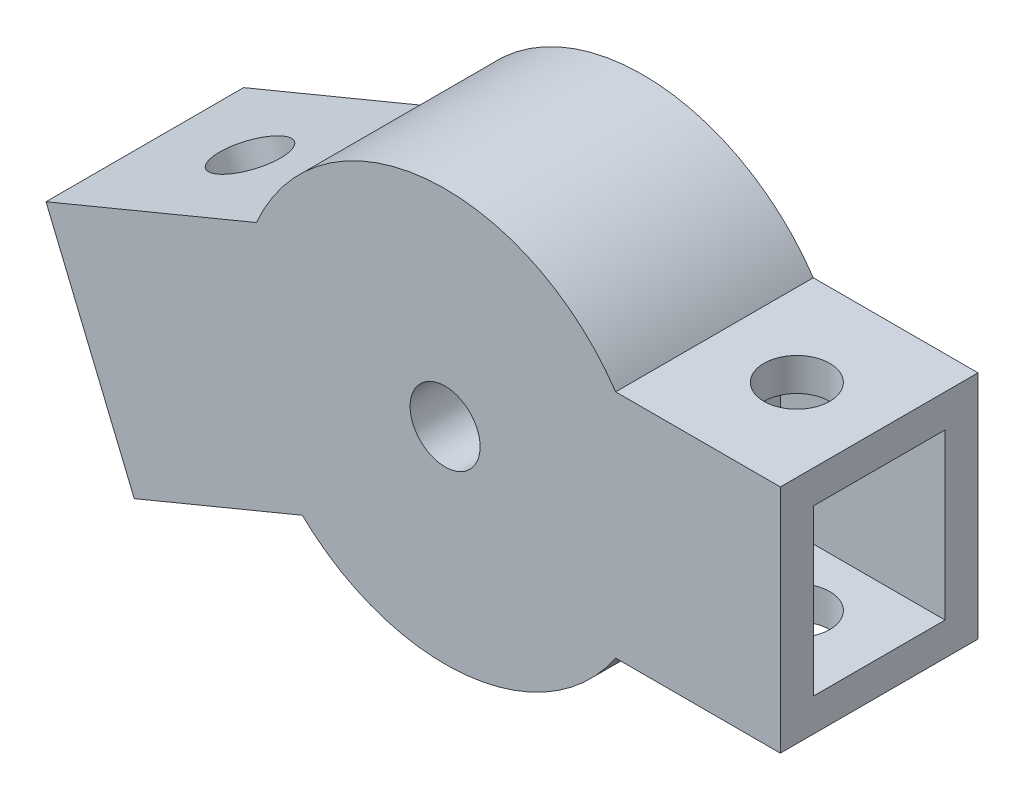
ISO-10303-21;
HEADER;
FILE_DESCRIPTION(('STEP AP214'),'2;1');
FILE_NAME('part.step','',(''),(''),'','','');
FILE_SCHEMA(('AUTOMOTIVE_DESIGN { 1 0 10303 214 1 1 1 1 }'));
ENDSEC;
DATA;
#1=APPLICATION_CONTEXT('core data for automotive mechanical design processes');
#2=APPLICATION_PROTOCOL_DEFINITION('international standard','automotive_design',2000,#1);
#3=PRODUCT_CONTEXT('',#1,'mechanical');
#4=PRODUCT('Part','Part','',(#3));
#5=PRODUCT_RELATED_PRODUCT_CATEGORY('part','',(#4));
#6=PRODUCT_DEFINITION_FORMATION('','',#4);
#7=PRODUCT_DEFINITION_CONTEXT('part definition',#1,'design');
#8=PRODUCT_DEFINITION('design','',#6,#7);
#9=PRODUCT_DEFINITION_SHAPE('','',#8);
#10=(LENGTH_UNIT() NAMED_UNIT(*) SI_UNIT(.MILLI.,.METRE.));
#11=(NAMED_UNIT(*) PLANE_ANGLE_UNIT() SI_UNIT($,.RADIAN.));
#12=(NAMED_UNIT(*) SI_UNIT($,.STERADIAN.) SOLID_ANGLE_UNIT());
#13=UNCERTAINTY_MEASURE_WITH_UNIT(LENGTH_MEASURE(1.E-05),#10,'distance_accuracy_value','');
#14=(GEOMETRIC_REPRESENTATION_CONTEXT(3) GLOBAL_UNCERTAINTY_ASSIGNED_CONTEXT((#13)) GLOBAL_UNIT_ASSIGNED_CONTEXT((#10,
#11,#12)) REPRESENTATION_CONTEXT('',''));
#15=CARTESIAN_POINT('',(0.,0.,0.));
#16=DIRECTION('',(0.,0.,1.));
#17=DIRECTION('',(1.,0.,0.));
#18=AXIS2_PLACEMENT_3D('',#15,#16,#17);
#19=CARTESIAN_POINT('',(0.,0.,12.));
#20=DIRECTION('',(0.,0.,-1.));
#21=DIRECTION('',(-1.,0.,0.));
#22=AXIS2_PLACEMENT_3D('',#19,#20,#21);
#23=CYLINDRICAL_SURFACE('',#22,12.5);
#24=DIRECTION('',(0.,0.,-1.));
#25=VECTOR('',#24,1.);
#26=CARTESIAN_POINT('',(-8.67095256505799,-9.00358715260275,12.));
#27=LINE('',#26,#25);
#28=CARTESIAN_POINT('',(-8.67095256505801,-9.00358715260278,12.));
#29=VERTEX_POINT('',#28);
#30=CARTESIAN_POINT('',(-8.67095256505799,-9.00358715260275,0.));
#31=VERTEX_POINT('',#30);
#32=EDGE_CURVE('E242',#29,#31,#27,.T.);
#33=ORIENTED_EDGE('',*,*,#32,.T.);
#34=CARTESIAN_POINT('',(0.,0.,0.));
#35=DIRECTION('',(0.,0.,1.));
#36=DIRECTION('',(1.,0.,0.));
#37=AXIS2_PLACEMENT_3D('',#34,#35,#36);
#38=CIRCLE('',#37,12.5);
#39=CARTESIAN_POINT('',(10.356157588604,-7.,0.));
#40=VERTEX_POINT('',#39);
#41=EDGE_CURVE('E279',#31,#40,#38,.T.);
#42=ORIENTED_EDGE('',*,*,#41,.T.);
#43=DIRECTION('',(0.,0.,-1.));
#44=VECTOR('',#43,1.);
#45=CARTESIAN_POINT('',(10.356157588604,-7.,12.));
#46=LINE('',#45,#44);
#47=CARTESIAN_POINT('',(10.356157588604,-7.,12.));
#48=VERTEX_POINT('',#47);
#49=EDGE_CURVE('E271',#48,#40,#46,.T.);
#50=ORIENTED_EDGE('',*,*,#49,.F.);
#51=CARTESIAN_POINT('',(0.,0.,12.));
#52=DIRECTION('',(0.,0.,1.));
#53=DIRECTION('',(1.,0.,0.));
#54=AXIS2_PLACEMENT_3D('',#51,#52,#53);
#55=CIRCLE('',#54,12.5);
#56=EDGE_CURVE('E44',#29,#48,#55,.T.);
#57=ORIENTED_EDGE('',*,*,#56,.F.);
#58=EDGE_LOOP('',(#33,#42,#50,#57));
#59=FACE_BOUND('',#58,.T.);
#60=ADVANCED_FACE('F36',(#59),#23,.T.);
#61=DIRECTION('',(0.,0.,-1.));
#62=VECTOR('',#61,1.);
#63=CARTESIAN_POINT('',(-11.458506301557,4.99526108798895,12.));
#64=LINE('',#63,#62);
#65=CARTESIAN_POINT('',(-11.4585063015571,4.99526108798891,12.));
#66=VERTEX_POINT('',#65);
#67=CARTESIAN_POINT('',(-11.4585063015571,4.99526108798891,0.));
#68=VERTEX_POINT('',#67);
#69=EDGE_CURVE('E239',#66,#68,#64,.T.);
#70=ORIENTED_EDGE('',*,*,#69,.F.);
#71=CARTESIAN_POINT('',(10.356157588604,7.,12.));
#72=VERTEX_POINT('',#71);
#73=EDGE_CURVE('E11',#72,#66,#55,.T.);
#74=ORIENTED_EDGE('',*,*,#73,.F.);
#75=DIRECTION('',(0.,0.,-1.));
#76=VECTOR('',#75,1.);
#77=CARTESIAN_POINT('',(10.356157588604,7.,12.));
#78=LINE('',#77,#76);
#79=CARTESIAN_POINT('',(10.356157588604,7.,0.));
#80=VERTEX_POINT('',#79);
#81=EDGE_CURVE('E257',#72,#80,#78,.T.);
#82=ORIENTED_EDGE('',*,*,#81,.T.);
#83=EDGE_CURVE('E281',#80,#68,#38,.T.);
#84=ORIENTED_EDGE('',*,*,#83,.T.);
#85=EDGE_LOOP('',(#70,#74,#82,#84));
#86=FACE_BOUND('',#85,.T.);
#87=ADVANCED_FACE('F344',(#86),#23,.T.);
#88=CARTESIAN_POINT('',(0.,0.,12.));
#89=DIRECTION('',(0.,0.,1.));
#90=DIRECTION('',(1.,0.,0.));
#91=AXIS2_PLACEMENT_3D('',#88,#89,#90);
#92=PLANE('',#91);
#93=CARTESIAN_POINT('',(0.,0.,12.));
#94=DIRECTION('',(0.,0.,1.));
#95=DIRECTION('',(1.,0.,0.));
#96=AXIS2_PLACEMENT_3D('',#93,#94,#95);
#97=CIRCLE('',#96,2.125);
#98=CARTESIAN_POINT('',(2.125,0.,12.));
#99=VERTEX_POINT('',#98);
#100=EDGE_CURVE('E274',#99,#99,#97,.T.);
#101=ORIENTED_EDGE('',*,*,#100,.F.);
#102=EDGE_LOOP('',(#101));
#103=FACE_BOUND('',#102,.T.);
#104=ORIENTED_EDGE('',*,*,#73,.T.);
#105=DIRECTION('',(-0.923879532511289,-0.382683432365084,0.));
#106=VECTOR('',#105,1.);
#107=CARTESIAN_POINT('',(-24.2314403727898,-0.295461435612971,12.));
#108=LINE('',#107,#106);
#109=CARTESIAN_POINT('',(-24.2314403727898,-0.295461435612971,12.));
#110=VERTEX_POINT('',#109);
#111=EDGE_CURVE('E228',#66,#110,#108,.T.);
#112=ORIENTED_EDGE('',*,*,#111,.T.);
#113=DIRECTION('',(0.382683432365093,-0.923879532511285,0.));
#114=VECTOR('',#113,1.);
#115=CARTESIAN_POINT('',(-20.7872894815039,-8.61037722821456,12.));
#116=LINE('',#115,#114);
#117=CARTESIAN_POINT('',(-18.8738723196785,-13.229774890771,12.));
#118=VERTEX_POINT('',#117);
#119=EDGE_CURVE('E222',#110,#118,#116,.T.);
#120=ORIENTED_EDGE('',*,*,#119,.T.);
#121=DIRECTION('',(0.923879532511285,0.382683432365093,0.));
#122=VECTOR('',#121,1.);
#123=CARTESIAN_POINT('',(-18.8738723196785,-13.229774890771,12.));
#124=LINE('',#123,#122);
#125=EDGE_CURVE('E224',#118,#29,#124,.T.);
#126=ORIENTED_EDGE('',*,*,#125,.T.);
#127=ORIENTED_EDGE('',*,*,#56,.T.);
#128=DIRECTION('',(1.,0.,0.));
#129=VECTOR('',#128,1.);
#130=CARTESIAN_POINT('',(20.356157588604,-7.,12.));
#131=LINE('',#130,#129);
#132=CARTESIAN_POINT('',(20.356157588604,-7.,12.));
#133=VERTEX_POINT('',#132);
#134=EDGE_CURVE('E249',#48,#133,#131,.T.);
#135=ORIENTED_EDGE('',*,*,#134,.T.);
#136=DIRECTION('',(0.,1.,0.));
#137=VECTOR('',#136,1.);
#138=CARTESIAN_POINT('',(20.356157588604,7.,12.));
#139=LINE('',#138,#137);
#140=CARTESIAN_POINT('',(20.356157588604,7.,12.));
#141=VERTEX_POINT('',#140);
#142=EDGE_CURVE('E251',#133,#141,#139,.T.);
#143=ORIENTED_EDGE('',*,*,#142,.T.);
#144=DIRECTION('',(-1.,0.,0.));
#145=VECTOR('',#144,1.);
#146=CARTESIAN_POINT('',(10.356157588604,7.,12.));
#147=LINE('',#146,#145);
#148=EDGE_CURVE('E254',#141,#72,#147,.T.);
#149=ORIENTED_EDGE('',*,*,#148,.T.);
#150=EDGE_LOOP('',(#104,#112,#120,#126,#127,#135,#143,#149));
#151=FACE_BOUND('',#150,.T.);
#152=ADVANCED_FACE('F335',(#103,#151),#92,.T.);
#153=CARTESIAN_POINT('',(0.,0.,0.));
#154=DIRECTION('',(0.,0.,1.));
#155=DIRECTION('',(1.,0.,0.));
#156=AXIS2_PLACEMENT_3D('',#153,#154,#155);
#157=PLANE('',#156);
#158=CARTESIAN_POINT('',(0.,0.,0.));
#159=DIRECTION('',(0.,0.,1.));
#160=DIRECTION('',(1.,0.,0.));
#161=AXIS2_PLACEMENT_3D('',#158,#159,#160);
#162=CIRCLE('',#161,2.125);
#163=CARTESIAN_POINT('',(2.125,0.,0.));
#164=VERTEX_POINT('',#163);
#165=EDGE_CURVE('E277',#164,#164,#162,.F.);
#166=ORIENTED_EDGE('',*,*,#165,.F.);
#167=EDGE_LOOP('',(#166));
#168=FACE_BOUND('',#167,.T.);
#169=ORIENTED_EDGE('',*,*,#83,.F.);
#170=DIRECTION('',(-1.,0.,0.));
#171=VECTOR('',#170,1.);
#172=CARTESIAN_POINT('',(10.356157588604,7.,0.));
#173=LINE('',#172,#171);
#174=CARTESIAN_POINT('',(20.356157588604,7.,0.));
#175=VERTEX_POINT('',#174);
#176=EDGE_CURVE('E252',#175,#80,#173,.T.);
#177=ORIENTED_EDGE('',*,*,#176,.F.);
#178=DIRECTION('',(0.,1.,0.));
#179=VECTOR('',#178,1.);
#180=CARTESIAN_POINT('',(20.356157588604,7.,0.));
#181=LINE('',#180,#179);
#182=CARTESIAN_POINT('',(20.356157588604,-7.,0.));
#183=VERTEX_POINT('',#182);
#184=EDGE_CURVE('E259',#183,#175,#181,.T.);
#185=ORIENTED_EDGE('',*,*,#184,.F.);
#186=DIRECTION('',(1.,0.,0.));
#187=VECTOR('',#186,1.);
#188=CARTESIAN_POINT('',(20.356157588604,-7.,0.));
#189=LINE('',#188,#187);
#190=EDGE_CURVE('E248',#40,#183,#189,.T.);
#191=ORIENTED_EDGE('',*,*,#190,.F.);
#192=ORIENTED_EDGE('',*,*,#41,.F.);
#193=DIRECTION('',(0.923879532511285,0.382683432365093,0.));
#194=VECTOR('',#193,1.);
#195=CARTESIAN_POINT('',(-18.8738723196785,-13.229774890771,0.));
#196=LINE('',#195,#194);
#197=CARTESIAN_POINT('',(-18.8738723196785,-13.229774890771,0.));
#198=VERTEX_POINT('',#197);
#199=EDGE_CURVE('E232',#198,#31,#196,.T.);
#200=ORIENTED_EDGE('',*,*,#199,.F.);
#201=DIRECTION('',(0.382683432365093,-0.923879532511286,0.));
#202=VECTOR('',#201,1.);
#203=CARTESIAN_POINT('',(-20.7872894815039,-8.61037722821456,0.));
#204=LINE('',#203,#202);
#205=CARTESIAN_POINT('',(-24.2314403727898,-0.295461435612971,0.));
#206=VERTEX_POINT('',#205);
#207=EDGE_CURVE('E216',#206,#198,#204,.T.);
#208=ORIENTED_EDGE('',*,*,#207,.F.);
#209=DIRECTION('',(-0.923879532511289,-0.382683432365084,0.));
#210=VECTOR('',#209,1.);
#211=CARTESIAN_POINT('',(-24.2314403727898,-0.295461435612971,0.));
#212=LINE('',#211,#210);
#213=EDGE_CURVE('E225',#68,#206,#212,.T.);
#214=ORIENTED_EDGE('',*,*,#213,.F.);
#215=EDGE_LOOP('',(#169,#177,#185,#191,#192,#200,#208,#214));
#216=FACE_BOUND('',#215,.T.);
#217=ADVANCED_FACE('F327',(#168,#216),#157,.F.);
#218=CARTESIAN_POINT('',(0.,0.,-0.000999999999999265));
#219=DIRECTION('',(0.,0.,1.));
#220=DIRECTION('',(1.,0.,0.));
#221=AXIS2_PLACEMENT_3D('',#218,#219,#220);
#222=CYLINDRICAL_SURFACE('',#221,2.125);
#223=ORIENTED_EDGE('',*,*,#100,.T.);
#224=EDGE_LOOP('',(#223));
#225=FACE_BOUND('',#224,.T.);
#226=ORIENTED_EDGE('',*,*,#165,.T.);
#227=EDGE_LOOP('',(#226));
#228=FACE_BOUND('',#227,.T.);
#229=ADVANCED_FACE('F356',(#225,#228),#222,.F.);
#230=CARTESIAN_POINT('',(20.356157588604,-7.,12.));
#231=DIRECTION('',(0.,1.,0.));
#232=DIRECTION('',(0.,0.,1.));
#233=AXIS2_PLACEMENT_3D('',#230,#231,#232);
#234=PLANE('',#233);
#235=CARTESIAN_POINT('',(15.356157588604,-7.,6.));
#236=DIRECTION('',(0.,1.,0.));
#237=DIRECTION('',(0.,0.,1.));
#238=AXIS2_PLACEMENT_3D('',#235,#236,#237);
#239=CIRCLE('',#238,2.);
#240=CARTESIAN_POINT('',(15.356157588604,-7.,8.));
#241=VERTEX_POINT('',#240);
#242=EDGE_CURVE('E176',#241,#241,#239,.T.);
#243=ORIENTED_EDGE('',*,*,#242,.T.);
#244=EDGE_LOOP('',(#243));
#245=FACE_BOUND('',#244,.T.);
#246=ORIENTED_EDGE('',*,*,#190,.T.);
#247=DIRECTION('',(0.,0.,-1.));
#248=VECTOR('',#247,1.);
#249=CARTESIAN_POINT('',(20.356157588604,-7.,12.));
#250=LINE('',#249,#248);
#251=EDGE_CURVE('E268',#133,#183,#250,.T.);
#252=ORIENTED_EDGE('',*,*,#251,.F.);
#253=ORIENTED_EDGE('',*,*,#134,.F.);
#254=ORIENTED_EDGE('',*,*,#49,.T.);
#255=EDGE_LOOP('',(#246,#252,#253,#254));
#256=FACE_BOUND('',#255,.T.);
#257=ADVANCED_FACE('F354',(#245,#256),#234,.F.);
#258=CARTESIAN_POINT('',(20.356157588604,7.,12.));
#259=DIRECTION('',(-1.,0.,0.));
#260=DIRECTION('',(0.,0.,1.));
#261=AXIS2_PLACEMENT_3D('',#258,#259,#260);
#262=PLANE('',#261);
#263=DIRECTION('',(0.,0.,-1.));
#264=VECTOR('',#263,1.);
#265=CARTESIAN_POINT('',(20.356157588604,-5.,10.));
#266=LINE('',#265,#264);
#267=CARTESIAN_POINT('',(20.356157588604,-5.,10.));
#268=VERTEX_POINT('',#267);
#269=CARTESIAN_POINT('',(20.356157588604,-5.,2.));
#270=VERTEX_POINT('',#269);
#271=EDGE_CURVE('E206',#268,#270,#266,.T.);
#272=ORIENTED_EDGE('',*,*,#271,.F.);
#273=DIRECTION('',(0.,-1.,0.));
#274=VECTOR('',#273,1.);
#275=CARTESIAN_POINT('',(20.356157588604,5.,10.));
#276=LINE('',#275,#274);
#277=CARTESIAN_POINT('',(20.356157588604,5.,10.));
#278=VERTEX_POINT('',#277);
#279=EDGE_CURVE('E60',#278,#268,#276,.T.);
#280=ORIENTED_EDGE('',*,*,#279,.F.);
#281=DIRECTION('',(0.,0.,1.));
#282=VECTOR('',#281,1.);
#283=CARTESIAN_POINT('',(20.356157588604,5.,10.));
#284=LINE('',#283,#282);
#285=CARTESIAN_POINT('',(20.356157588604,5.,2.));
#286=VERTEX_POINT('',#285);
#287=EDGE_CURVE('E195',#286,#278,#284,.T.);
#288=ORIENTED_EDGE('',*,*,#287,.F.);
#289=DIRECTION('',(0.,1.,0.));
#290=VECTOR('',#289,1.);
#291=CARTESIAN_POINT('',(20.356157588604,5.,2.));
#292=LINE('',#291,#290);
#293=EDGE_CURVE('E209',#270,#286,#292,.T.);
#294=ORIENTED_EDGE('',*,*,#293,.F.);
#295=EDGE_LOOP('',(#272,#280,#288,#294));
#296=FACE_BOUND('',#295,.T.);
#297=ORIENTED_EDGE('',*,*,#184,.T.);
#298=DIRECTION('',(0.,0.,-1.));
#299=VECTOR('',#298,1.);
#300=CARTESIAN_POINT('',(20.356157588604,7.,12.));
#301=LINE('',#300,#299);
#302=EDGE_CURVE('E265',#141,#175,#301,.T.);
#303=ORIENTED_EDGE('',*,*,#302,.F.);
#304=ORIENTED_EDGE('',*,*,#142,.F.);
#305=ORIENTED_EDGE('',*,*,#251,.T.);
#306=EDGE_LOOP('',(#297,#303,#304,#305));
#307=FACE_BOUND('',#306,.T.);
#308=ADVANCED_FACE('F351',(#296,#307),#262,.F.);
#309=CARTESIAN_POINT('',(10.356157588604,7.,12.));
#310=DIRECTION('',(0.,-1.,0.));
#311=DIRECTION('',(0.,0.,-1.));
#312=AXIS2_PLACEMENT_3D('',#309,#310,#311);
#313=PLANE('',#312);
#314=CARTESIAN_POINT('',(15.356157588604,7.,6.));
#315=DIRECTION('',(0.,1.,0.));
#316=DIRECTION('',(0.,0.,1.));
#317=AXIS2_PLACEMENT_3D('',#314,#315,#316);
#318=CIRCLE('',#317,2.);
#319=CARTESIAN_POINT('',(15.356157588604,7.,8.));
#320=VERTEX_POINT('',#319);
#321=EDGE_CURVE('E285',#320,#320,#318,.T.);
#322=ORIENTED_EDGE('',*,*,#321,.F.);
#323=EDGE_LOOP('',(#322));
#324=FACE_BOUND('',#323,.T.);
#325=ORIENTED_EDGE('',*,*,#176,.T.);
#326=ORIENTED_EDGE('',*,*,#81,.F.);
#327=ORIENTED_EDGE('',*,*,#148,.F.);
#328=ORIENTED_EDGE('',*,*,#302,.T.);
#329=EDGE_LOOP('',(#325,#326,#327,#328));
#330=FACE_BOUND('',#329,.T.);
#331=ADVANCED_FACE('F347',(#324,#330),#313,.F.);
#332=CARTESIAN_POINT('',(-20.7872894815039,-8.61037722821456,12.));
#333=DIRECTION('',(0.923879532511285,0.382683432365093,0.));
#334=DIRECTION('',(-0.382683432365093,0.923879532511286,0.));
#335=AXIS2_PLACEMENT_3D('',#332,#333,#334);
#336=PLANE('',#335);
#337=DIRECTION('',(0.,0.,1.));
#338=VECTOR('',#337,1.);
#339=CARTESIAN_POINT('',(-19.6392391844087,-11.3820158257484,2.));
#340=LINE('',#339,#338);
#341=CARTESIAN_POINT('',(-19.6392391844087,-11.3820158257484,2.));
#342=VERTEX_POINT('',#341);
#343=CARTESIAN_POINT('',(-19.6392391844087,-11.3820158257484,10.));
#344=VERTEX_POINT('',#343);
#345=EDGE_CURVE('E182',#342,#344,#340,.T.);
#346=ORIENTED_EDGE('',*,*,#345,.F.);
#347=DIRECTION('',(0.382683432365093,-0.923879532511286,0.));
#348=VECTOR('',#347,1.);
#349=CARTESIAN_POINT('',(-23.4660735080596,-2.14322050063554,2.));
#350=LINE('',#349,#348);
#351=CARTESIAN_POINT('',(-23.4660735080596,-2.14322050063554,2.));
#352=VERTEX_POINT('',#351);
#353=EDGE_CURVE('E52',#352,#342,#350,.T.);
#354=ORIENTED_EDGE('',*,*,#353,.F.);
#355=DIRECTION('',(0.,0.,-1.));
#356=VECTOR('',#355,1.);
#357=CARTESIAN_POINT('',(-23.4660735080596,-2.14322050063554,2.));
#358=LINE('',#357,#356);
#359=CARTESIAN_POINT('',(-23.4660735080596,-2.14322050063554,10.));
#360=VERTEX_POINT('',#359);
#361=EDGE_CURVE('E170',#360,#352,#358,.T.);
#362=ORIENTED_EDGE('',*,*,#361,.F.);
#363=DIRECTION('',(-0.382683432365093,0.923879532511286,0.));
#364=VECTOR('',#363,1.);
#365=CARTESIAN_POINT('',(-23.4660735080596,-2.14322050063554,10.));
#366=LINE('',#365,#364);
#367=EDGE_CURVE('E173',#344,#360,#366,.T.);
#368=ORIENTED_EDGE('',*,*,#367,.F.);
#369=EDGE_LOOP('',(#346,#354,#362,#368));
#370=FACE_BOUND('',#369,.T.);
#371=ORIENTED_EDGE('',*,*,#207,.T.);
#372=DIRECTION('',(0.,0.,-1.));
#373=VECTOR('',#372,1.);
#374=CARTESIAN_POINT('',(-18.8738723196785,-13.229774890771,12.));
#375=LINE('',#374,#373);
#376=EDGE_CURVE('E245',#118,#198,#375,.T.);
#377=ORIENTED_EDGE('',*,*,#376,.F.);
#378=ORIENTED_EDGE('',*,*,#119,.F.);
#379=DIRECTION('',(0.,0.,-1.));
#380=VECTOR('',#379,1.);
#381=CARTESIAN_POINT('',(-24.2314403727898,-0.295461435612971,12.));
#382=LINE('',#381,#380);
#383=EDGE_CURVE('E230',#110,#206,#382,.T.);
#384=ORIENTED_EDGE('',*,*,#383,.T.);
#385=EDGE_LOOP('',(#371,#377,#378,#384));
#386=FACE_BOUND('',#385,.T.);
#387=ADVANCED_FACE('F320',(#370,#386),#336,.F.);
#388=CARTESIAN_POINT('',(-18.8738723196785,-13.229774890771,12.));
#389=DIRECTION('',(-0.382683432365093,0.923879532511285,0.));
#390=DIRECTION('',(-0.923879532511286,-0.382683432365093,0.));
#391=AXIS2_PLACEMENT_3D('',#388,#389,#390);
#392=PLANE('',#391);
#393=CARTESIAN_POINT('',(-12.4874052840623,-10.58441362897,6.));
#394=DIRECTION('',(-0.382683432365093,0.923879532511285,0.));
#395=DIRECTION('',(-0.923879532511286,-0.382683432365093,0.));
#396=AXIS2_PLACEMENT_3D('',#393,#394,#395);
#397=CIRCLE('',#396,2.);
#398=CARTESIAN_POINT('',(-14.3351643490849,-11.3497804937002,6.));
#399=VERTEX_POINT('',#398);
#400=EDGE_CURVE('E290',#399,#399,#397,.T.);
#401=ORIENTED_EDGE('',*,*,#400,.T.);
#402=EDGE_LOOP('',(#401));
#403=FACE_BOUND('',#402,.T.);
#404=ORIENTED_EDGE('',*,*,#199,.T.);
#405=ORIENTED_EDGE('',*,*,#32,.F.);
#406=ORIENTED_EDGE('',*,*,#125,.F.);
#407=ORIENTED_EDGE('',*,*,#376,.T.);
#408=EDGE_LOOP('',(#404,#405,#406,#407));
#409=FACE_BOUND('',#408,.T.);
#410=ADVANCED_FACE('F316',(#403,#409),#392,.F.);
#411=CARTESIAN_POINT('',(-24.2314403727898,-0.295461435612971,12.));
#412=DIRECTION('',(0.382683432365084,-0.923879532511289,0.));
#413=DIRECTION('',(0.923879532511289,0.382683432365084,0.));
#414=AXIS2_PLACEMENT_3D('',#411,#412,#413);
#415=PLANE('',#414);
#416=CARTESIAN_POINT('',(-17.8449733371734,2.34989982618797,6.));
#417=DIRECTION('',(-0.382683432365084,0.923879532511289,0.));
#418=DIRECTION('',(-0.923879532511289,-0.382683432365084,0.));
#419=AXIS2_PLACEMENT_3D('',#416,#417,#418);
#420=CIRCLE('',#419,2.);
#421=CARTESIAN_POINT('',(-19.692732402196,1.5845329614578,6.));
#422=VERTEX_POINT('',#421);
#423=EDGE_CURVE('E300',#422,#422,#420,.T.);
#424=ORIENTED_EDGE('',*,*,#423,.F.);
#425=EDGE_LOOP('',(#424));
#426=FACE_BOUND('',#425,.T.);
#427=ORIENTED_EDGE('',*,*,#213,.T.);
#428=ORIENTED_EDGE('',*,*,#383,.F.);
#429=ORIENTED_EDGE('',*,*,#111,.F.);
#430=ORIENTED_EDGE('',*,*,#69,.T.);
#431=EDGE_LOOP('',(#427,#428,#429,#430));
#432=FACE_BOUND('',#431,.T.);
#433=ADVANCED_FACE('F319',(#426,#432),#415,.F.);
#434=CARTESIAN_POINT('',(10.356157588604,5.,10.));
#435=DIRECTION('',(0.,0.,1.));
#436=DIRECTION('',(0.,-1.,0.));
#437=AXIS2_PLACEMENT_3D('',#434,#435,#436);
#438=PLANE('',#437);
#439=ORIENTED_EDGE('',*,*,#279,.T.);
#440=DIRECTION('',(1.,0.,0.));
#441=VECTOR('',#440,1.);
#442=CARTESIAN_POINT('',(10.356157588604,-5.,10.));
#443=LINE('',#442,#441);
#444=CARTESIAN_POINT('',(10.356157588604,-5.,10.));
#445=VERTEX_POINT('',#444);
#446=EDGE_CURVE('E204',#445,#268,#443,.T.);
#447=ORIENTED_EDGE('',*,*,#446,.F.);
#448=DIRECTION('',(0.,-1.,0.));
#449=VECTOR('',#448,1.);
#450=CARTESIAN_POINT('',(10.356157588604,5.,10.));
#451=LINE('',#450,#449);
#452=CARTESIAN_POINT('',(10.356157588604,5.,10.));
#453=VERTEX_POINT('',#452);
#454=EDGE_CURVE('E191',#453,#445,#451,.T.);
#455=ORIENTED_EDGE('',*,*,#454,.F.);
#456=DIRECTION('',(1.,0.,0.));
#457=VECTOR('',#456,1.);
#458=CARTESIAN_POINT('',(10.356157588604,5.,10.));
#459=LINE('',#458,#457);
#460=EDGE_CURVE('E214',#453,#278,#459,.T.);
#461=ORIENTED_EDGE('',*,*,#460,.T.);
#462=EDGE_LOOP('',(#439,#447,#455,#461));
#463=FACE_BOUND('',#462,.T.);
#464=ADVANCED_FACE('F463',(#463),#438,.F.);
#465=CARTESIAN_POINT('',(10.356157588604,5.,10.));
#466=DIRECTION('',(0.,1.,0.));
#467=DIRECTION('',(0.,0.,1.));
#468=AXIS2_PLACEMENT_3D('',#465,#466,#467);
#469=PLANE('',#468);
#470=CARTESIAN_POINT('',(15.356157588604,5.,6.));
#471=DIRECTION('',(0.,1.,0.));
#472=DIRECTION('',(0.,0.,1.));
#473=AXIS2_PLACEMENT_3D('',#470,#471,#472);
#474=CIRCLE('',#473,2.);
#475=CARTESIAN_POINT('',(15.356157588604,5.,8.));
#476=VERTEX_POINT('',#475);
#477=EDGE_CURVE('E284',#476,#476,#474,.T.);
#478=ORIENTED_EDGE('',*,*,#477,.T.);
#479=EDGE_LOOP('',(#478));
#480=FACE_BOUND('',#479,.T.);
#481=ORIENTED_EDGE('',*,*,#287,.T.);
#482=ORIENTED_EDGE('',*,*,#460,.F.);
#483=DIRECTION('',(0.,0.,1.));
#484=VECTOR('',#483,1.);
#485=CARTESIAN_POINT('',(10.356157588604,5.,10.));
#486=LINE('',#485,#484);
#487=CARTESIAN_POINT('',(10.356157588604,5.,2.));
#488=VERTEX_POINT('',#487);
#489=EDGE_CURVE('E201',#488,#453,#486,.T.);
#490=ORIENTED_EDGE('',*,*,#489,.F.);
#491=DIRECTION('',(1.,0.,0.));
#492=VECTOR('',#491,1.);
#493=CARTESIAN_POINT('',(10.356157588604,5.,2.));
#494=LINE('',#493,#492);
#495=EDGE_CURVE('E217',#488,#286,#494,.T.);
#496=ORIENTED_EDGE('',*,*,#495,.T.);
#497=EDGE_LOOP('',(#481,#482,#490,#496));
#498=FACE_BOUND('',#497,.T.);
#499=ADVANCED_FACE('F472',(#480,#498),#469,.F.);
#500=CARTESIAN_POINT('',(10.356157588604,5.,2.));
#501=DIRECTION('',(0.,0.,-1.));
#502=DIRECTION('',(0.,1.,0.));
#503=AXIS2_PLACEMENT_3D('',#500,#501,#502);
#504=PLANE('',#503);
#505=ORIENTED_EDGE('',*,*,#293,.T.);
#506=ORIENTED_EDGE('',*,*,#495,.F.);
#507=DIRECTION('',(0.,1.,0.));
#508=VECTOR('',#507,1.);
#509=CARTESIAN_POINT('',(10.356157588604,5.,2.));
#510=LINE('',#509,#508);
#511=CARTESIAN_POINT('',(10.356157588604,-5.,2.));
#512=VERTEX_POINT('',#511);
#513=EDGE_CURVE('E198',#512,#488,#510,.T.);
#514=ORIENTED_EDGE('',*,*,#513,.F.);
#515=DIRECTION('',(1.,0.,0.));
#516=VECTOR('',#515,1.);
#517=CARTESIAN_POINT('',(10.356157588604,-5.,2.));
#518=LINE('',#517,#516);
#519=EDGE_CURVE('E219',#512,#270,#518,.T.);
#520=ORIENTED_EDGE('',*,*,#519,.T.);
#521=EDGE_LOOP('',(#505,#506,#514,#520));
#522=FACE_BOUND('',#521,.T.);
#523=ADVANCED_FACE('F480',(#522),#504,.F.);
#524=CARTESIAN_POINT('',(10.356157588604,-5.,10.));
#525=DIRECTION('',(0.,-1.,0.));
#526=DIRECTION('',(0.,0.,-1.));
#527=AXIS2_PLACEMENT_3D('',#524,#525,#526);
#528=PLANE('',#527);
#529=CARTESIAN_POINT('',(15.356157588604,-5.,6.));
#530=DIRECTION('',(0.,-1.,0.));
#531=DIRECTION('',(0.,0.,-1.));
#532=AXIS2_PLACEMENT_3D('',#529,#530,#531);
#533=CIRCLE('',#532,2.);
#534=CARTESIAN_POINT('',(15.356157588604,-5.,4.));
#535=VERTEX_POINT('',#534);
#536=EDGE_CURVE('E282',#535,#535,#533,.T.);
#537=ORIENTED_EDGE('',*,*,#536,.T.);
#538=EDGE_LOOP('',(#537));
#539=FACE_BOUND('',#538,.T.);
#540=ORIENTED_EDGE('',*,*,#271,.T.);
#541=ORIENTED_EDGE('',*,*,#519,.F.);
#542=DIRECTION('',(0.,0.,-1.));
#543=VECTOR('',#542,1.);
#544=CARTESIAN_POINT('',(10.356157588604,-5.,10.));
#545=LINE('',#544,#543);
#546=EDGE_CURVE('E194',#445,#512,#545,.T.);
#547=ORIENTED_EDGE('',*,*,#546,.F.);
#548=ORIENTED_EDGE('',*,*,#446,.T.);
#549=EDGE_LOOP('',(#540,#541,#547,#548));
#550=FACE_BOUND('',#549,.T.);
#551=ADVANCED_FACE('F489',(#539,#550),#528,.F.);
#552=CARTESIAN_POINT('',(10.356157588604,0.,0.));
#553=DIRECTION('',(1.,0.,0.));
#554=DIRECTION('',(0.,0.,-1.));
#555=AXIS2_PLACEMENT_3D('',#552,#553,#554);
#556=PLANE('',#555);
#557=ORIENTED_EDGE('',*,*,#454,.T.);
#558=ORIENTED_EDGE('',*,*,#546,.T.);
#559=ORIENTED_EDGE('',*,*,#513,.T.);
#560=ORIENTED_EDGE('',*,*,#489,.T.);
#561=EDGE_LOOP('',(#557,#558,#559,#560));
#562=FACE_BOUND('',#561,.T.);
#563=ADVANCED_FACE('F497',(#562),#556,.T.);
#564=CARTESIAN_POINT('',(-14.2272781829467,1.68361382301538,2.));
#565=DIRECTION('',(0.,0.,-1.));
#566=DIRECTION('',(0.,1.,0.));
#567=AXIS2_PLACEMENT_3D('',#564,#565,#566);
#568=PLANE('',#567);
#569=ORIENTED_EDGE('',*,*,#353,.T.);
#570=DIRECTION('',(-0.923879532511286,-0.382683432365093,0.));
#571=VECTOR('',#570,1.);
#572=CARTESIAN_POINT('',(-10.4004438592958,-7.55518150209749,2.));
#573=LINE('',#572,#571);
#574=CARTESIAN_POINT('',(-10.4004438592958,-7.55518150209749,2.));
#575=VERTEX_POINT('',#574);
#576=EDGE_CURVE('E148',#575,#342,#573,.T.);
#577=ORIENTED_EDGE('',*,*,#576,.F.);
#578=DIRECTION('',(0.382683432365093,-0.923879532511286,0.));
#579=VECTOR('',#578,1.);
#580=CARTESIAN_POINT('',(-14.2272781829467,1.68361382301538,2.));
#581=LINE('',#580,#579);
#582=CARTESIAN_POINT('',(-14.2272781829467,1.68361382301538,2.));
#583=VERTEX_POINT('',#582);
#584=EDGE_CURVE('E152',#583,#575,#581,.T.);
#585=ORIENTED_EDGE('',*,*,#584,.F.);
#586=DIRECTION('',(-0.923879532511286,-0.382683432365093,0.));
#587=VECTOR('',#586,1.);
#588=CARTESIAN_POINT('',(-14.2272781829467,1.68361382301538,2.));
#589=LINE('',#588,#587);
#590=EDGE_CURVE('E186',#583,#352,#589,.T.);
#591=ORIENTED_EDGE('',*,*,#590,.T.);
#592=EDGE_LOOP('',(#569,#577,#585,#591));
#593=FACE_BOUND('',#592,.T.);
#594=ADVANCED_FACE('F150',(#593),#568,.F.);
#595=CARTESIAN_POINT('',(-14.2272781829467,1.68361382301538,2.));
#596=DIRECTION('',(-0.382683432365093,0.923879532511286,0.));
#597=DIRECTION('',(-0.923879532511286,-0.382683432365093,0.));
#598=AXIS2_PLACEMENT_3D('',#595,#596,#597);
#599=PLANE('',#598);
#600=CARTESIAN_POINT('',(-17.0796064724433,0.502140761165452,6.));
#601=DIRECTION('',(-0.382683432365093,0.923879532511286,0.));
#602=DIRECTION('',(-0.923879532511286,-0.382683432365093,0.));
#603=AXIS2_PLACEMENT_3D('',#600,#601,#602);
#604=CIRCLE('',#603,2.);
#605=CARTESIAN_POINT('',(-18.9273655374659,-0.263226103564734,6.));
#606=VERTEX_POINT('',#605);
#607=EDGE_CURVE('E295',#606,#606,#604,.T.);
#608=ORIENTED_EDGE('',*,*,#607,.T.);
#609=EDGE_LOOP('',(#608));
#610=FACE_BOUND('',#609,.T.);
#611=ORIENTED_EDGE('',*,*,#361,.T.);
#612=ORIENTED_EDGE('',*,*,#590,.F.);
#613=DIRECTION('',(0.,0.,-1.));
#614=VECTOR('',#613,1.);
#615=CARTESIAN_POINT('',(-14.2272781829467,1.68361382301538,2.));
#616=LINE('',#615,#614);
#617=CARTESIAN_POINT('',(-14.2272781829467,1.68361382301538,10.));
#618=VERTEX_POINT('',#617);
#619=EDGE_CURVE('E158',#618,#583,#616,.T.);
#620=ORIENTED_EDGE('',*,*,#619,.F.);
#621=DIRECTION('',(-0.923879532511286,-0.382683432365093,0.));
#622=VECTOR('',#621,1.);
#623=CARTESIAN_POINT('',(-14.2272781829467,1.68361382301538,10.));
#624=LINE('',#623,#622);
#625=EDGE_CURVE('E188',#618,#360,#624,.T.);
#626=ORIENTED_EDGE('',*,*,#625,.T.);
#627=EDGE_LOOP('',(#611,#612,#620,#626));
#628=FACE_BOUND('',#627,.T.);
#629=ADVANCED_FACE('F512',(#610,#628),#599,.F.);
#630=CARTESIAN_POINT('',(-14.2272781829467,1.68361382301538,10.));
#631=DIRECTION('',(0.,0.,1.));
#632=DIRECTION('',(0.,-1.,0.));
#633=AXIS2_PLACEMENT_3D('',#630,#631,#632);
#634=PLANE('',#633);
#635=ORIENTED_EDGE('',*,*,#367,.T.);
#636=ORIENTED_EDGE('',*,*,#625,.F.);
#637=DIRECTION('',(-0.382683432365093,0.923879532511286,0.));
#638=VECTOR('',#637,1.);
#639=CARTESIAN_POINT('',(-14.2272781829467,1.68361382301538,10.));
#640=LINE('',#639,#638);
#641=CARTESIAN_POINT('',(-10.4004438592958,-7.55518150209749,10.));
#642=VERTEX_POINT('',#641);
#643=EDGE_CURVE('E166',#642,#618,#640,.T.);
#644=ORIENTED_EDGE('',*,*,#643,.F.);
#645=DIRECTION('',(-0.923879532511286,-0.382683432365093,0.));
#646=VECTOR('',#645,1.);
#647=CARTESIAN_POINT('',(-10.4004438592958,-7.55518150209749,10.));
#648=LINE('',#647,#646);
#649=EDGE_CURVE('E157',#642,#344,#648,.T.);
#650=ORIENTED_EDGE('',*,*,#649,.T.);
#651=EDGE_LOOP('',(#635,#636,#644,#650));
#652=FACE_BOUND('',#651,.T.);
#653=ADVANCED_FACE('F520',(#652),#634,.F.);
#654=CARTESIAN_POINT('',(-10.4004438592958,-7.55518150209749,2.));
#655=DIRECTION('',(0.382683432365093,-0.923879532511286,0.));
#656=DIRECTION('',(0.923879532511286,0.382683432365093,0.));
#657=AXIS2_PLACEMENT_3D('',#654,#655,#656);
#658=PLANE('',#657);
#659=CARTESIAN_POINT('',(-13.2527721487925,-8.73665456394746,6.));
#660=DIRECTION('',(0.382683432365093,-0.923879532511286,0.));
#661=DIRECTION('',(0.923879532511286,0.382683432365093,0.));
#662=AXIS2_PLACEMENT_3D('',#659,#660,#661);
#663=CIRCLE('',#662,2.);
#664=CARTESIAN_POINT('',(-11.4050130837699,-7.97128769921727,6.));
#665=VERTEX_POINT('',#664);
#666=EDGE_CURVE('E39',#665,#665,#663,.T.);
#667=ORIENTED_EDGE('',*,*,#666,.T.);
#668=EDGE_LOOP('',(#667));
#669=FACE_BOUND('',#668,.T.);
#670=ORIENTED_EDGE('',*,*,#345,.T.);
#671=ORIENTED_EDGE('',*,*,#649,.F.);
#672=DIRECTION('',(0.,0.,1.));
#673=VECTOR('',#672,1.);
#674=CARTESIAN_POINT('',(-10.4004438592958,-7.55518150209749,2.));
#675=LINE('',#674,#673);
#676=EDGE_CURVE('E161',#575,#642,#675,.T.);
#677=ORIENTED_EDGE('',*,*,#676,.F.);
#678=ORIENTED_EDGE('',*,*,#576,.T.);
#679=EDGE_LOOP('',(#670,#671,#677,#678));
#680=FACE_BOUND('',#679,.T.);
#681=ADVANCED_FACE('F162',(#669,#680),#658,.F.);
#682=CARTESIAN_POINT('',(-11.5484941563911,-4.78354290456366,0.));
#683=DIRECTION('',(-0.923879532511286,-0.382683432365093,0.));
#684=DIRECTION('',(0.382683432365093,-0.923879532511286,0.));
#685=AXIS2_PLACEMENT_3D('',#682,#683,#684);
#686=PLANE('',#685);
#687=ORIENTED_EDGE('',*,*,#584,.T.);
#688=ORIENTED_EDGE('',*,*,#676,.T.);
#689=ORIENTED_EDGE('',*,*,#643,.T.);
#690=ORIENTED_EDGE('',*,*,#619,.T.);
#691=EDGE_LOOP('',(#687,#688,#689,#690));
#692=FACE_BOUND('',#691,.T.);
#693=ADVANCED_FACE('F168',(#692),#686,.T.);
#694=CARTESIAN_POINT('',(15.356157588604,-13.229774890771,6.));
#695=DIRECTION('',(0.,1.,0.));
#696=DIRECTION('',(0.,0.,1.));
#697=AXIS2_PLACEMENT_3D('',#694,#695,#696);
#698=CYLINDRICAL_SURFACE('',#697,2.);
#699=ORIENTED_EDGE('',*,*,#536,.F.);
#700=EDGE_LOOP('',(#699));
#701=FACE_BOUND('',#700,.T.);
#702=ORIENTED_EDGE('',*,*,#242,.F.);
#703=EDGE_LOOP('',(#702));
#704=FACE_BOUND('',#703,.T.);
#705=ADVANCED_FACE('F543',(#701,#704),#698,.F.);
#706=ORIENTED_EDGE('',*,*,#321,.T.);
#707=EDGE_LOOP('',(#706));
#708=FACE_BOUND('',#707,.T.);
#709=ORIENTED_EDGE('',*,*,#477,.F.);
#710=EDGE_LOOP('',(#709));
#711=FACE_BOUND('',#710,.T.);
#712=ADVANCED_FACE('F312',(#708,#711),#698,.F.);
#713=CARTESIAN_POINT('',(-6.74230041706999,-24.4543237161187,6.));
#714=DIRECTION('',(-0.382683432365084,0.923879532511289,0.));
#715=DIRECTION('',(-0.923879532511289,-0.382683432365084,0.));
#716=AXIS2_PLACEMENT_3D('',#713,#714,#715);
#717=CYLINDRICAL_SURFACE('',#716,2.);
#718=ORIENTED_EDGE('',*,*,#666,.F.);
#719=EDGE_LOOP('',(#718));
#720=FACE_BOUND('',#719,.T.);
#721=ORIENTED_EDGE('',*,*,#400,.F.);
#722=EDGE_LOOP('',(#721));
#723=FACE_BOUND('',#722,.T.);
#724=ADVANCED_FACE('F308',(#720,#723),#717,.F.);
#725=ORIENTED_EDGE('',*,*,#423,.T.);
#726=EDGE_LOOP('',(#725));
#727=FACE_BOUND('',#726,.T.);
#728=ORIENTED_EDGE('',*,*,#607,.F.);
#729=EDGE_LOOP('',(#728));
#730=FACE_BOUND('',#729,.T.);
#731=ADVANCED_FACE('F311',(#727,#730),#717,.F.);
#732=CLOSED_SHELL('',(#60,#87,#152,#217,#229,#257,#308,#331,#387,#410,#433,#464,#499,#523,#551,
#563,#594,#629,#653,#681,#693,#705,#712,#724,#731));
#733=MANIFOLD_SOLID_BREP('B2',#732);
#734=ADVANCED_BREP_SHAPE_REPRESENTATION('',(#18,#733),#14);
#735=SHAPE_DEFINITION_REPRESENTATION(#9,#734);
ENDSEC;
END-ISO-10303-21;
